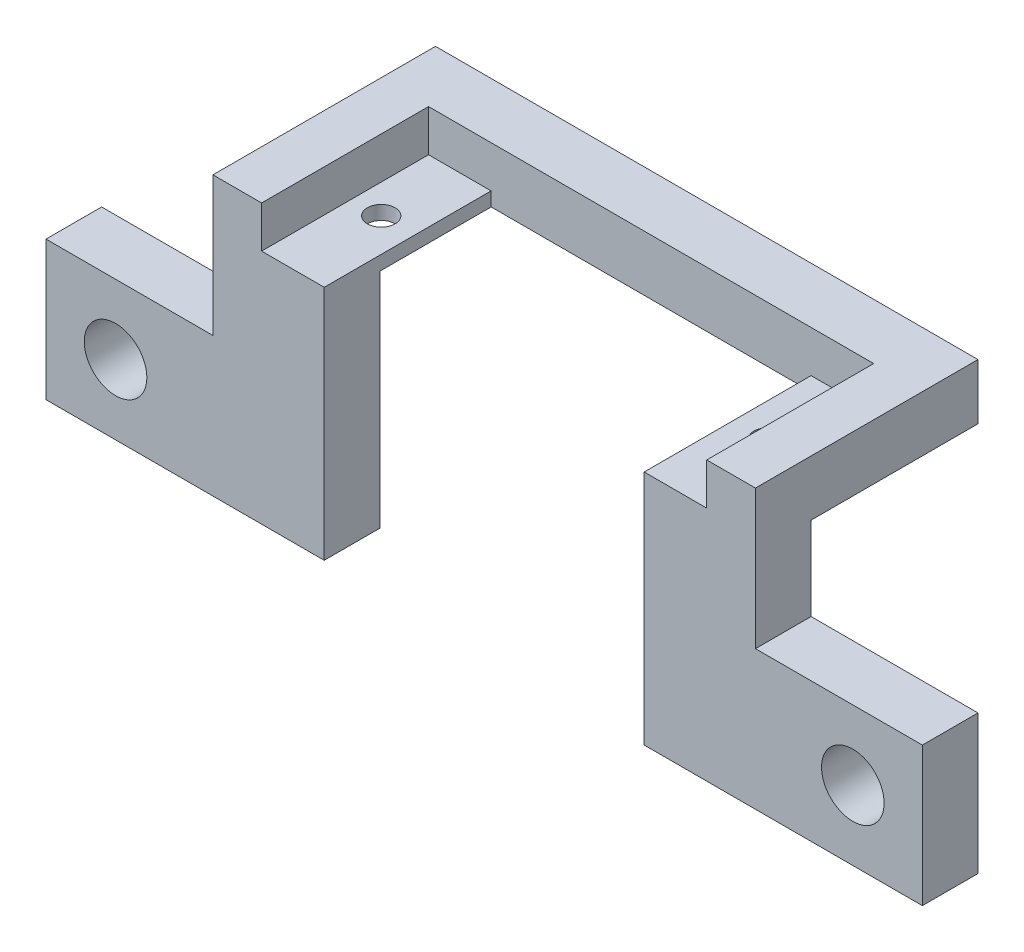
ISO-10303-21;
HEADER;
FILE_DESCRIPTION(('STEP AP214'),'2;1');
FILE_NAME('part.step','',(''),(''),'','','');
FILE_SCHEMA(('AUTOMOTIVE_DESIGN { 1 0 10303 214 1 1 1 1 }'));
ENDSEC;
DATA;
#1=APPLICATION_CONTEXT('core data for automotive mechanical design processes');
#2=APPLICATION_PROTOCOL_DEFINITION('international standard','automotive_design',2000,#1);
#3=PRODUCT_CONTEXT('',#1,'mechanical');
#4=PRODUCT('Part','Part','',(#3));
#5=PRODUCT_RELATED_PRODUCT_CATEGORY('part','',(#4));
#6=PRODUCT_DEFINITION_FORMATION('','',#4);
#7=PRODUCT_DEFINITION_CONTEXT('part definition',#1,'design');
#8=PRODUCT_DEFINITION('design','',#6,#7);
#9=PRODUCT_DEFINITION_SHAPE('','',#8);
#10=(LENGTH_UNIT() NAMED_UNIT(*) SI_UNIT(.MILLI.,.METRE.));
#11=(NAMED_UNIT(*) PLANE_ANGLE_UNIT() SI_UNIT($,.RADIAN.));
#12=(NAMED_UNIT(*) SI_UNIT($,.STERADIAN.) SOLID_ANGLE_UNIT());
#13=UNCERTAINTY_MEASURE_WITH_UNIT(LENGTH_MEASURE(1.E-05),#10,'distance_accuracy_value','');
#14=(GEOMETRIC_REPRESENTATION_CONTEXT(3) GLOBAL_UNCERTAINTY_ASSIGNED_CONTEXT((#13)) GLOBAL_UNIT_ASSIGNED_CONTEXT((#10,
#11,#12)) REPRESENTATION_CONTEXT('',''));
#15=CARTESIAN_POINT('',(0.,0.,0.));
#16=DIRECTION('',(0.,0.,1.));
#17=DIRECTION('',(1.,0.,0.));
#18=AXIS2_PLACEMENT_3D('',#15,#16,#17);
#19=CARTESIAN_POINT('',(-11.5,4.,12.));
#20=DIRECTION('',(-1.,0.,0.));
#21=DIRECTION('',(0.,0.,1.));
#22=AXIS2_PLACEMENT_3D('',#19,#20,#21);
#23=PLANE('',#22);
#24=DIRECTION('',(0.,0.,-1.));
#25=VECTOR('',#24,1.);
#26=CARTESIAN_POINT('',(-11.5,1.,12.));
#27=LINE('',#26,#25);
#28=CARTESIAN_POINT('',(-11.5,1.,12.));
#29=VERTEX_POINT('',#28);
#30=CARTESIAN_POINT('',(-11.5,1.,0.));
#31=VERTEX_POINT('',#30);
#32=EDGE_CURVE('E252',#29,#31,#27,.T.);
#33=ORIENTED_EDGE('',*,*,#32,.F.);
#34=DIRECTION('',(0.,-1.,0.));
#35=VECTOR('',#34,1.);
#36=CARTESIAN_POINT('',(-11.5,4.,12.));
#37=LINE('',#36,#35);
#38=CARTESIAN_POINT('',(-11.5,-16.,12.));
#39=VERTEX_POINT('',#38);
#40=EDGE_CURVE('E220',#29,#39,#37,.T.);
#41=ORIENTED_EDGE('',*,*,#40,.T.);
#42=DIRECTION('',(0.,0.,1.));
#43=VECTOR('',#42,1.);
#44=CARTESIAN_POINT('',(-11.5,-16.,8.));
#45=LINE('',#44,#43);
#46=CARTESIAN_POINT('',(-11.5,-16.,8.));
#47=VERTEX_POINT('',#46);
#48=EDGE_CURVE('E344',#47,#39,#45,.T.);
#49=ORIENTED_EDGE('',*,*,#48,.F.);
#50=DIRECTION('',(0.,1.,0.));
#51=VECTOR('',#50,1.);
#52=CARTESIAN_POINT('',(-11.5,4.,8.));
#53=LINE('',#52,#51);
#54=CARTESIAN_POINT('',(-11.5,0.,8.));
#55=VERTEX_POINT('',#54);
#56=EDGE_CURVE('E330',#47,#55,#53,.T.);
#57=ORIENTED_EDGE('',*,*,#56,.T.);
#58=DIRECTION('',(0.,0.,-1.));
#59=VECTOR('',#58,1.);
#60=CARTESIAN_POINT('',(-11.5,0.,12.));
#61=LINE('',#60,#59);
#62=CARTESIAN_POINT('',(-11.5,0.,0.));
#63=VERTEX_POINT('',#62);
#64=EDGE_CURVE('E390',#55,#63,#61,.T.);
#65=ORIENTED_EDGE('',*,*,#64,.T.);
#66=DIRECTION('',(0.,-1.,0.));
#67=VECTOR('',#66,1.);
#68=CARTESIAN_POINT('',(-11.5,4.,0.));
#69=LINE('',#68,#67);
#70=EDGE_CURVE('E415',#31,#63,#69,.T.);
#71=ORIENTED_EDGE('',*,*,#70,.F.);
#72=EDGE_LOOP('',(#33,#41,#49,#57,#65,#71));
#73=FACE_BOUND('',#72,.T.);
#74=ADVANCED_FACE('F40',(#73),#23,.F.);
#75=CARTESIAN_POINT('',(11.5,4.,12.));
#76=DIRECTION('',(1.,0.,0.));
#77=DIRECTION('',(0.,0.,-1.));
#78=AXIS2_PLACEMENT_3D('',#75,#76,#77);
#79=PLANE('',#78);
#80=DIRECTION('',(0.,0.,1.));
#81=VECTOR('',#80,1.);
#82=CARTESIAN_POINT('',(11.5,1.,12.));
#83=LINE('',#82,#81);
#84=CARTESIAN_POINT('',(11.5,1.,0.));
#85=VERTEX_POINT('',#84);
#86=CARTESIAN_POINT('',(11.5,1.,12.));
#87=VERTEX_POINT('',#86);
#88=EDGE_CURVE('E249',#85,#87,#83,.T.);
#89=ORIENTED_EDGE('',*,*,#88,.F.);
#90=DIRECTION('',(0.,-1.,0.));
#91=VECTOR('',#90,1.);
#92=CARTESIAN_POINT('',(11.5,4.,0.));
#93=LINE('',#92,#91);
#94=CARTESIAN_POINT('',(11.5,0.,0.));
#95=VERTEX_POINT('',#94);
#96=EDGE_CURVE('E412',#85,#95,#93,.T.);
#97=ORIENTED_EDGE('',*,*,#96,.T.);
#98=DIRECTION('',(0.,0.,1.));
#99=VECTOR('',#98,1.);
#100=CARTESIAN_POINT('',(11.5,0.,12.));
#101=LINE('',#100,#99);
#102=CARTESIAN_POINT('',(11.5,0.,8.));
#103=VERTEX_POINT('',#102);
#104=EDGE_CURVE('E398',#95,#103,#101,.T.);
#105=ORIENTED_EDGE('',*,*,#104,.T.);
#106=DIRECTION('',(0.,-1.,0.));
#107=VECTOR('',#106,1.);
#108=CARTESIAN_POINT('',(11.5,4.,8.));
#109=LINE('',#108,#107);
#110=CARTESIAN_POINT('',(11.5,-16.,8.));
#111=VERTEX_POINT('',#110);
#112=EDGE_CURVE('E268',#103,#111,#109,.T.);
#113=ORIENTED_EDGE('',*,*,#112,.T.);
#114=DIRECTION('',(0.,0.,1.));
#115=VECTOR('',#114,1.);
#116=CARTESIAN_POINT('',(11.5,-16.,8.));
#117=LINE('',#116,#115);
#118=CARTESIAN_POINT('',(11.5,-16.,12.));
#119=VERTEX_POINT('',#118);
#120=EDGE_CURVE('E276',#111,#119,#117,.T.);
#121=ORIENTED_EDGE('',*,*,#120,.T.);
#122=DIRECTION('',(0.,-1.,0.));
#123=VECTOR('',#122,1.);
#124=CARTESIAN_POINT('',(11.5,4.,12.));
#125=LINE('',#124,#123);
#126=EDGE_CURVE('E409',#87,#119,#125,.T.);
#127=ORIENTED_EDGE('',*,*,#126,.F.);
#128=EDGE_LOOP('',(#89,#97,#105,#113,#121,#127));
#129=FACE_BOUND('',#128,.T.);
#130=ADVANCED_FACE('F452',(#129),#79,.F.);
#131=CARTESIAN_POINT('',(13.9,4.,5.5));
#132=DIRECTION('',(0.,1.,0.));
#133=DIRECTION('',(0.,0.,1.));
#134=AXIS2_PLACEMENT_3D('',#131,#132,#133);
#135=CYLINDRICAL_SURFACE('',#134,0.999999999999991);
#136=CARTESIAN_POINT('',(13.9,0.,5.5));
#137=DIRECTION('',(0.,1.,0.));
#138=DIRECTION('',(0.,0.,1.));
#139=AXIS2_PLACEMENT_3D('',#136,#137,#138);
#140=CIRCLE('',#139,0.999999999999996);
#141=CARTESIAN_POINT('',(13.9,0.,6.5));
#142=VERTEX_POINT('',#141);
#143=EDGE_CURVE('E361',#142,#142,#140,.T.);
#144=ORIENTED_EDGE('',*,*,#143,.F.);
#145=EDGE_LOOP('',(#144));
#146=FACE_BOUND('',#145,.T.);
#147=CARTESIAN_POINT('',(13.9,1.,5.5));
#148=DIRECTION('',(0.,1.,0.));
#149=DIRECTION('',(0.,0.,1.));
#150=AXIS2_PLACEMENT_3D('',#147,#148,#149);
#151=CIRCLE('',#150,0.999999999999991);
#152=CARTESIAN_POINT('',(13.9,1.,6.49999999999999));
#153=VERTEX_POINT('',#152);
#154=EDGE_CURVE('E245',#153,#153,#151,.F.);
#155=ORIENTED_EDGE('',*,*,#154,.F.);
#156=EDGE_LOOP('',(#155));
#157=FACE_BOUND('',#156,.T.);
#158=ADVANCED_FACE('F458',(#146,#157),#135,.F.);
#159=CARTESIAN_POINT('',(-13.9,4.,5.5));
#160=DIRECTION('',(0.,1.,0.));
#161=DIRECTION('',(0.,0.,1.));
#162=AXIS2_PLACEMENT_3D('',#159,#160,#161);
#163=CYLINDRICAL_SURFACE('',#162,0.999999999999991);
#164=CARTESIAN_POINT('',(-13.9,0.,5.5));
#165=DIRECTION('',(0.,1.,0.));
#166=DIRECTION('',(0.,0.,1.));
#167=AXIS2_PLACEMENT_3D('',#164,#165,#166);
#168=CIRCLE('',#167,0.999999999999996);
#169=CARTESIAN_POINT('',(-13.9,0.,6.5));
#170=VERTEX_POINT('',#169);
#171=EDGE_CURVE('E348',#170,#170,#168,.T.);
#172=ORIENTED_EDGE('',*,*,#171,.F.);
#173=EDGE_LOOP('',(#172));
#174=FACE_BOUND('',#173,.T.);
#175=CARTESIAN_POINT('',(-13.9,1.,5.5));
#176=DIRECTION('',(0.,1.,0.));
#177=DIRECTION('',(0.,0.,1.));
#178=AXIS2_PLACEMENT_3D('',#175,#176,#177);
#179=CIRCLE('',#178,0.999999999999991);
#180=CARTESIAN_POINT('',(-13.9,1.,6.49999999999999));
#181=VERTEX_POINT('',#180);
#182=EDGE_CURVE('E44',#181,#181,#179,.F.);
#183=ORIENTED_EDGE('',*,*,#182,.F.);
#184=EDGE_LOOP('',(#183));
#185=FACE_BOUND('',#184,.T.);
#186=ADVANCED_FACE('F506',(#174,#185),#163,.F.);
#187=CARTESIAN_POINT('',(0.,0.,0.));
#188=DIRECTION('',(0.,-1.,0.));
#189=DIRECTION('',(0.,0.,-1.));
#190=AXIS2_PLACEMENT_3D('',#187,#188,#189);
#191=PLANE('',#190);
#192=ORIENTED_EDGE('',*,*,#171,.T.);
#193=EDGE_LOOP('',(#192));
#194=FACE_BOUND('',#193,.T.);
#195=ORIENTED_EDGE('',*,*,#143,.T.);
#196=EDGE_LOOP('',(#195));
#197=FACE_BOUND('',#196,.T.);
#198=DIRECTION('',(0.,0.,-1.));
#199=VECTOR('',#198,1.);
#200=CARTESIAN_POINT('',(19.5,0.,-4.));
#201=LINE('',#200,#199);
#202=CARTESIAN_POINT('',(19.5,0.,8.));
#203=VERTEX_POINT('',#202);
#204=CARTESIAN_POINT('',(19.5,0.,-4.));
#205=VERTEX_POINT('',#204);
#206=EDGE_CURVE('E88',#203,#205,#201,.T.);
#207=ORIENTED_EDGE('',*,*,#206,.F.);
#208=DIRECTION('',(-1.,0.,0.));
#209=VECTOR('',#208,1.);
#210=CARTESIAN_POINT('',(0.,0.,8.));
#211=LINE('',#210,#209);
#212=EDGE_CURVE('E293',#203,#103,#211,.T.);
#213=ORIENTED_EDGE('',*,*,#212,.T.);
#214=ORIENTED_EDGE('',*,*,#104,.F.);
#215=DIRECTION('',(1.,0.,0.));
#216=VECTOR('',#215,1.);
#217=CARTESIAN_POINT('',(-11.5,0.,0.));
#218=LINE('',#217,#216);
#219=EDGE_CURVE('E394',#63,#95,#218,.T.);
#220=ORIENTED_EDGE('',*,*,#219,.F.);
#221=ORIENTED_EDGE('',*,*,#64,.F.);
#222=DIRECTION('',(-1.,0.,0.));
#223=VECTOR('',#222,1.);
#224=CARTESIAN_POINT('',(0.,0.,8.));
#225=LINE('',#224,#223);
#226=CARTESIAN_POINT('',(-19.5,0.,8.));
#227=VERTEX_POINT('',#226);
#228=EDGE_CURVE('E11',#55,#227,#225,.T.);
#229=ORIENTED_EDGE('',*,*,#228,.T.);
#230=DIRECTION('',(0.,0.,1.));
#231=VECTOR('',#230,1.);
#232=CARTESIAN_POINT('',(-19.5,0.,-4.));
#233=LINE('',#232,#231);
#234=CARTESIAN_POINT('',(-19.5,0.,-4.));
#235=VERTEX_POINT('',#234);
#236=EDGE_CURVE('E386',#235,#227,#233,.T.);
#237=ORIENTED_EDGE('',*,*,#236,.F.);
#238=DIRECTION('',(-1.,0.,0.));
#239=VECTOR('',#238,1.);
#240=CARTESIAN_POINT('',(-19.5,0.,-4.));
#241=LINE('',#240,#239);
#242=EDGE_CURVE('E365',#205,#235,#241,.T.);
#243=ORIENTED_EDGE('',*,*,#242,.F.);
#244=EDGE_LOOP('',(#207,#213,#214,#220,#221,#229,#237,#243));
#245=FACE_BOUND('',#244,.T.);
#246=ADVANCED_FACE('F471',(#194,#197,#245),#191,.T.);
#247=CARTESIAN_POINT('',(-19.5,4.,-4.));
#248=DIRECTION('',(0.,0.,1.));
#249=DIRECTION('',(1.,0.,0.));
#250=AXIS2_PLACEMENT_3D('',#247,#248,#249);
#251=PLANE('',#250);
#252=ORIENTED_EDGE('',*,*,#242,.T.);
#253=DIRECTION('',(0.,-1.,0.));
#254=VECTOR('',#253,1.);
#255=CARTESIAN_POINT('',(-19.5,4.,-4.));
#256=LINE('',#255,#254);
#257=CARTESIAN_POINT('',(-19.5,4.,-4.));
#258=VERTEX_POINT('',#257);
#259=EDGE_CURVE('E50',#258,#235,#256,.T.);
#260=ORIENTED_EDGE('',*,*,#259,.F.);
#261=DIRECTION('',(-1.,0.,0.));
#262=VECTOR('',#261,1.);
#263=CARTESIAN_POINT('',(-19.5,4.,-4.));
#264=LINE('',#263,#262);
#265=CARTESIAN_POINT('',(19.5,4.,-4.));
#266=VERTEX_POINT('',#265);
#267=EDGE_CURVE('E366',#266,#258,#264,.T.);
#268=ORIENTED_EDGE('',*,*,#267,.F.);
#269=DIRECTION('',(0.,-1.,0.));
#270=VECTOR('',#269,1.);
#271=CARTESIAN_POINT('',(19.5,4.,-4.));
#272=LINE('',#271,#270);
#273=EDGE_CURVE('E382',#266,#205,#272,.T.);
#274=ORIENTED_EDGE('',*,*,#273,.T.);
#275=EDGE_LOOP('',(#252,#260,#268,#274));
#276=FACE_BOUND('',#275,.T.);
#277=ADVANCED_FACE('F42',(#276),#251,.F.);
#278=CARTESIAN_POINT('',(-19.5,4.,-4.));
#279=DIRECTION('',(1.,0.,0.));
#280=DIRECTION('',(0.,0.,-1.));
#281=AXIS2_PLACEMENT_3D('',#278,#279,#280);
#282=PLANE('',#281);
#283=DIRECTION('',(0.,-1.,0.));
#284=VECTOR('',#283,1.);
#285=CARTESIAN_POINT('',(-19.5,4.,12.));
#286=LINE('',#285,#284);
#287=CARTESIAN_POINT('',(-19.5,4.,12.));
#288=VERTEX_POINT('',#287);
#289=CARTESIAN_POINT('',(-19.5,-6.,12.));
#290=VERTEX_POINT('',#289);
#291=EDGE_CURVE('E420',#288,#290,#286,.T.);
#292=ORIENTED_EDGE('',*,*,#291,.F.);
#293=DIRECTION('',(0.,0.,1.));
#294=VECTOR('',#293,1.);
#295=CARTESIAN_POINT('',(-19.5,4.,-4.));
#296=LINE('',#295,#294);
#297=EDGE_CURVE('E96',#258,#288,#296,.T.);
#298=ORIENTED_EDGE('',*,*,#297,.F.);
#299=ORIENTED_EDGE('',*,*,#259,.T.);
#300=ORIENTED_EDGE('',*,*,#236,.T.);
#301=DIRECTION('',(0.,-1.,0.));
#302=VECTOR('',#301,1.);
#303=CARTESIAN_POINT('',(-19.5,4.,8.));
#304=LINE('',#303,#302);
#305=CARTESIAN_POINT('',(-19.5,-6.,8.));
#306=VERTEX_POINT('',#305);
#307=EDGE_CURVE('E314',#227,#306,#304,.T.);
#308=ORIENTED_EDGE('',*,*,#307,.T.);
#309=DIRECTION('',(0.,0.,1.));
#310=VECTOR('',#309,1.);
#311=CARTESIAN_POINT('',(-19.5,-6.,8.));
#312=LINE('',#311,#310);
#313=EDGE_CURVE('E334',#306,#290,#312,.T.);
#314=ORIENTED_EDGE('',*,*,#313,.T.);
#315=EDGE_LOOP('',(#292,#298,#299,#300,#308,#314));
#316=FACE_BOUND('',#315,.T.);
#317=ADVANCED_FACE('F465',(#316),#282,.F.);
#318=CARTESIAN_POINT('',(-19.5,4.,12.));
#319=DIRECTION('',(0.,0.,-1.));
#320=DIRECTION('',(-1.,0.,0.));
#321=AXIS2_PLACEMENT_3D('',#318,#319,#320);
#322=PLANE('',#321);
#323=CARTESIAN_POINT('',(-26.5,-11.,12.));
#324=DIRECTION('',(0.,0.,1.));
#325=DIRECTION('',(1.,0.,0.));
#326=AXIS2_PLACEMENT_3D('',#323,#324,#325);
#327=CIRCLE('',#326,2.24999999999999);
#328=CARTESIAN_POINT('',(-24.25,-11.,12.));
#329=VERTEX_POINT('',#328);
#330=EDGE_CURVE('E255',#329,#329,#327,.T.);
#331=ORIENTED_EDGE('',*,*,#330,.F.);
#332=EDGE_LOOP('',(#331));
#333=FACE_BOUND('',#332,.T.);
#334=DIRECTION('',(1.,0.,0.));
#335=VECTOR('',#334,1.);
#336=CARTESIAN_POINT('',(-16.,1.,12.));
#337=LINE('',#336,#335);
#338=CARTESIAN_POINT('',(-16.,1.,12.));
#339=VERTEX_POINT('',#338);
#340=EDGE_CURVE('E208',#339,#29,#337,.T.);
#341=ORIENTED_EDGE('',*,*,#340,.F.);
#342=DIRECTION('',(0.,1.,0.));
#343=VECTOR('',#342,1.);
#344=CARTESIAN_POINT('',(-16.,1.,12.));
#345=LINE('',#344,#343);
#346=CARTESIAN_POINT('',(-16.,4.,12.));
#347=VERTEX_POINT('',#346);
#348=EDGE_CURVE('E192',#339,#347,#345,.T.);
#349=ORIENTED_EDGE('',*,*,#348,.T.);
#350=DIRECTION('',(1.,0.,0.));
#351=VECTOR('',#350,1.);
#352=CARTESIAN_POINT('',(-19.5,4.,12.));
#353=LINE('',#352,#351);
#354=EDGE_CURVE('E371',#288,#347,#353,.T.);
#355=ORIENTED_EDGE('',*,*,#354,.F.);
#356=ORIENTED_EDGE('',*,*,#291,.T.);
#357=DIRECTION('',(-1.,0.,0.));
#358=VECTOR('',#357,1.);
#359=CARTESIAN_POINT('',(-31.5,-6.,12.));
#360=LINE('',#359,#358);
#361=CARTESIAN_POINT('',(-31.5,-6.,12.));
#362=VERTEX_POINT('',#361);
#363=EDGE_CURVE('E313',#290,#362,#360,.T.);
#364=ORIENTED_EDGE('',*,*,#363,.T.);
#365=DIRECTION('',(0.,-1.,0.));
#366=VECTOR('',#365,1.);
#367=CARTESIAN_POINT('',(-31.5,-16.,12.));
#368=LINE('',#367,#366);
#369=CARTESIAN_POINT('',(-31.5,-16.,12.));
#370=VERTEX_POINT('',#369);
#371=EDGE_CURVE('E338',#362,#370,#368,.T.);
#372=ORIENTED_EDGE('',*,*,#371,.T.);
#373=DIRECTION('',(1.,0.,0.));
#374=VECTOR('',#373,1.);
#375=CARTESIAN_POINT('',(-31.5,-16.,12.));
#376=LINE('',#375,#374);
#377=EDGE_CURVE('E318',#370,#39,#376,.T.);
#378=ORIENTED_EDGE('',*,*,#377,.T.);
#379=ORIENTED_EDGE('',*,*,#40,.F.);
#380=EDGE_LOOP('',(#341,#349,#355,#356,#364,#372,#378,#379));
#381=FACE_BOUND('',#380,.T.);
#382=ADVANCED_FACE('F218',(#333,#381),#322,.F.);
#383=CARTESIAN_POINT('',(-11.5,4.,0.));
#384=DIRECTION('',(0.,0.,-1.));
#385=DIRECTION('',(-1.,0.,0.));
#386=AXIS2_PLACEMENT_3D('',#383,#384,#385);
#387=PLANE('',#386);
#388=DIRECTION('',(1.,0.,0.));
#389=VECTOR('',#388,1.);
#390=CARTESIAN_POINT('',(-11.5,4.,0.));
#391=LINE('',#390,#389);
#392=CARTESIAN_POINT('',(-16.,4.,0.));
#393=VERTEX_POINT('',#392);
#394=CARTESIAN_POINT('',(16.,4.,0.));
#395=VERTEX_POINT('',#394);
#396=EDGE_CURVE('E374',#393,#395,#391,.T.);
#397=ORIENTED_EDGE('',*,*,#396,.F.);
#398=DIRECTION('',(0.,1.,0.));
#399=VECTOR('',#398,1.);
#400=CARTESIAN_POINT('',(-16.,1.,0.));
#401=LINE('',#400,#399);
#402=CARTESIAN_POINT('',(-16.,1.,0.));
#403=VERTEX_POINT('',#402);
#404=EDGE_CURVE('E236',#403,#393,#401,.T.);
#405=ORIENTED_EDGE('',*,*,#404,.F.);
#406=DIRECTION('',(-1.,0.,0.));
#407=VECTOR('',#406,1.);
#408=CARTESIAN_POINT('',(-16.,1.,0.));
#409=LINE('',#408,#407);
#410=EDGE_CURVE('E211',#31,#403,#409,.T.);
#411=ORIENTED_EDGE('',*,*,#410,.F.);
#412=ORIENTED_EDGE('',*,*,#70,.T.);
#413=ORIENTED_EDGE('',*,*,#219,.T.);
#414=ORIENTED_EDGE('',*,*,#96,.F.);
#415=CARTESIAN_POINT('',(16.,1.,0.));
#416=VERTEX_POINT('',#415);
#417=EDGE_CURVE('E204',#416,#85,#409,.T.);
#418=ORIENTED_EDGE('',*,*,#417,.F.);
#419=DIRECTION('',(0.,1.,0.));
#420=VECTOR('',#419,1.);
#421=CARTESIAN_POINT('',(16.,1.,0.));
#422=LINE('',#421,#420);
#423=EDGE_CURVE('E239',#416,#395,#422,.T.);
#424=ORIENTED_EDGE('',*,*,#423,.T.);
#425=EDGE_LOOP('',(#397,#405,#411,#412,#413,#414,#418,#424));
#426=FACE_BOUND('',#425,.T.);
#427=ADVANCED_FACE('F463',(#426),#387,.F.);
#428=CARTESIAN_POINT('',(19.5,4.,12.));
#429=DIRECTION('',(0.,0.,-1.));
#430=DIRECTION('',(-1.,0.,0.));
#431=AXIS2_PLACEMENT_3D('',#428,#429,#430);
#432=PLANE('',#431);
#433=CARTESIAN_POINT('',(26.5,-11.,12.));
#434=DIRECTION('',(0.,0.,1.));
#435=DIRECTION('',(1.,0.,0.));
#436=AXIS2_PLACEMENT_3D('',#433,#434,#435);
#437=CIRCLE('',#436,2.24999999999999);
#438=CARTESIAN_POINT('',(28.75,-11.,12.));
#439=VERTEX_POINT('',#438);
#440=EDGE_CURVE('E260',#439,#439,#437,.T.);
#441=ORIENTED_EDGE('',*,*,#440,.F.);
#442=EDGE_LOOP('',(#441));
#443=FACE_BOUND('',#442,.T.);
#444=DIRECTION('',(1.,0.,0.));
#445=VECTOR('',#444,1.);
#446=CARTESIAN_POINT('',(19.5,4.,12.));
#447=LINE('',#446,#445);
#448=CARTESIAN_POINT('',(16.,4.,12.));
#449=VERTEX_POINT('',#448);
#450=CARTESIAN_POINT('',(19.5,4.,12.));
#451=VERTEX_POINT('',#450);
#452=EDGE_CURVE('E377',#449,#451,#447,.T.);
#453=ORIENTED_EDGE('',*,*,#452,.F.);
#454=DIRECTION('',(0.,1.,0.));
#455=VECTOR('',#454,1.);
#456=CARTESIAN_POINT('',(16.,1.,12.));
#457=LINE('',#456,#455);
#458=CARTESIAN_POINT('',(16.,1.,12.));
#459=VERTEX_POINT('',#458);
#460=EDGE_CURVE('E58',#459,#449,#457,.T.);
#461=ORIENTED_EDGE('',*,*,#460,.F.);
#462=EDGE_CURVE('E214',#87,#459,#337,.T.);
#463=ORIENTED_EDGE('',*,*,#462,.F.);
#464=ORIENTED_EDGE('',*,*,#126,.T.);
#465=DIRECTION('',(1.,0.,0.));
#466=VECTOR('',#465,1.);
#467=CARTESIAN_POINT('',(31.5,-16.,12.));
#468=LINE('',#467,#466);
#469=CARTESIAN_POINT('',(31.5,-16.,12.));
#470=VERTEX_POINT('',#469);
#471=EDGE_CURVE('E289',#119,#470,#468,.T.);
#472=ORIENTED_EDGE('',*,*,#471,.T.);
#473=DIRECTION('',(0.,1.,0.));
#474=VECTOR('',#473,1.);
#475=CARTESIAN_POINT('',(31.5,-16.,12.));
#476=LINE('',#475,#474);
#477=CARTESIAN_POINT('',(31.5,-6.,12.));
#478=VERTEX_POINT('',#477);
#479=EDGE_CURVE('E284',#470,#478,#476,.T.);
#480=ORIENTED_EDGE('',*,*,#479,.T.);
#481=DIRECTION('',(-1.,0.,0.));
#482=VECTOR('',#481,1.);
#483=CARTESIAN_POINT('',(31.5,-6.,12.));
#484=LINE('',#483,#482);
#485=CARTESIAN_POINT('',(19.5,-6.,12.));
#486=VERTEX_POINT('',#485);
#487=EDGE_CURVE('E280',#478,#486,#484,.T.);
#488=ORIENTED_EDGE('',*,*,#487,.T.);
#489=DIRECTION('',(0.,-1.,0.));
#490=VECTOR('',#489,1.);
#491=CARTESIAN_POINT('',(19.5,4.,12.));
#492=LINE('',#491,#490);
#493=EDGE_CURVE('E406',#451,#486,#492,.T.);
#494=ORIENTED_EDGE('',*,*,#493,.F.);
#495=EDGE_LOOP('',(#453,#461,#463,#464,#472,#480,#488,#494));
#496=FACE_BOUND('',#495,.T.);
#497=ADVANCED_FACE('F521',(#443,#496),#432,.F.);
#498=CARTESIAN_POINT('',(19.5,4.,-4.));
#499=DIRECTION('',(-1.,0.,0.));
#500=DIRECTION('',(0.,0.,1.));
#501=AXIS2_PLACEMENT_3D('',#498,#499,#500);
#502=PLANE('',#501);
#503=ORIENTED_EDGE('',*,*,#493,.T.);
#504=DIRECTION('',(0.,0.,1.));
#505=VECTOR('',#504,1.);
#506=CARTESIAN_POINT('',(19.5,-6.,8.));
#507=LINE('',#506,#505);
#508=CARTESIAN_POINT('',(19.5,-6.,8.));
#509=VERTEX_POINT('',#508);
#510=EDGE_CURVE('E272',#509,#486,#507,.T.);
#511=ORIENTED_EDGE('',*,*,#510,.F.);
#512=DIRECTION('',(0.,1.,0.));
#513=VECTOR('',#512,1.);
#514=CARTESIAN_POINT('',(19.5,4.,8.));
#515=LINE('',#514,#513);
#516=EDGE_CURVE('E296',#509,#203,#515,.T.);
#517=ORIENTED_EDGE('',*,*,#516,.T.);
#518=ORIENTED_EDGE('',*,*,#206,.T.);
#519=ORIENTED_EDGE('',*,*,#273,.F.);
#520=DIRECTION('',(0.,0.,-1.));
#521=VECTOR('',#520,1.);
#522=CARTESIAN_POINT('',(19.5,4.,-4.));
#523=LINE('',#522,#521);
#524=EDGE_CURVE('E67',#451,#266,#523,.T.);
#525=ORIENTED_EDGE('',*,*,#524,.F.);
#526=EDGE_LOOP('',(#503,#511,#517,#518,#519,#525));
#527=FACE_BOUND('',#526,.T.);
#528=ADVANCED_FACE('F515',(#527),#502,.F.);
#529=CARTESIAN_POINT('',(0.,4.,0.));
#530=DIRECTION('',(0.,-1.,0.));
#531=DIRECTION('',(0.,0.,-1.));
#532=AXIS2_PLACEMENT_3D('',#529,#530,#531);
#533=PLANE('',#532);
#534=ORIENTED_EDGE('',*,*,#354,.T.);
#535=DIRECTION('',(0.,0.,1.));
#536=VECTOR('',#535,1.);
#537=CARTESIAN_POINT('',(-16.,4.,0.));
#538=LINE('',#537,#536);
#539=EDGE_CURVE('E198',#393,#347,#538,.T.);
#540=ORIENTED_EDGE('',*,*,#539,.F.);
#541=ORIENTED_EDGE('',*,*,#396,.T.);
#542=DIRECTION('',(0.,0.,-1.));
#543=VECTOR('',#542,1.);
#544=CARTESIAN_POINT('',(16.,4.,0.));
#545=LINE('',#544,#543);
#546=EDGE_CURVE('E215',#449,#395,#545,.T.);
#547=ORIENTED_EDGE('',*,*,#546,.F.);
#548=ORIENTED_EDGE('',*,*,#452,.T.);
#549=ORIENTED_EDGE('',*,*,#524,.T.);
#550=ORIENTED_EDGE('',*,*,#267,.T.);
#551=ORIENTED_EDGE('',*,*,#297,.T.);
#552=EDGE_LOOP('',(#534,#540,#541,#547,#548,#549,#550,#551));
#553=FACE_BOUND('',#552,.T.);
#554=ADVANCED_FACE('F475',(#553),#533,.F.);
#555=CARTESIAN_POINT('',(-31.5,-16.,8.));
#556=DIRECTION('',(0.,-1.,0.));
#557=DIRECTION('',(0.,0.,-1.));
#558=AXIS2_PLACEMENT_3D('',#555,#556,#557);
#559=PLANE('',#558);
#560=ORIENTED_EDGE('',*,*,#377,.F.);
#561=DIRECTION('',(0.,0.,1.));
#562=VECTOR('',#561,1.);
#563=CARTESIAN_POINT('',(-31.5,-16.,8.));
#564=LINE('',#563,#562);
#565=CARTESIAN_POINT('',(-31.5,-16.,8.));
#566=VERTEX_POINT('',#565);
#567=EDGE_CURVE('E349',#566,#370,#564,.T.);
#568=ORIENTED_EDGE('',*,*,#567,.F.);
#569=DIRECTION('',(1.,0.,0.));
#570=VECTOR('',#569,1.);
#571=CARTESIAN_POINT('',(-31.5,-16.,8.));
#572=LINE('',#571,#570);
#573=EDGE_CURVE('E326',#566,#47,#572,.T.);
#574=ORIENTED_EDGE('',*,*,#573,.T.);
#575=ORIENTED_EDGE('',*,*,#48,.T.);
#576=EDGE_LOOP('',(#560,#568,#574,#575));
#577=FACE_BOUND('',#576,.T.);
#578=ADVANCED_FACE('F488',(#577),#559,.T.);
#579=CARTESIAN_POINT('',(-31.5,-16.,8.));
#580=DIRECTION('',(-1.,0.,0.));
#581=DIRECTION('',(0.,0.,1.));
#582=AXIS2_PLACEMENT_3D('',#579,#580,#581);
#583=PLANE('',#582);
#584=ORIENTED_EDGE('',*,*,#371,.F.);
#585=DIRECTION('',(0.,0.,1.));
#586=VECTOR('',#585,1.);
#587=CARTESIAN_POINT('',(-31.5,-6.,8.));
#588=LINE('',#587,#586);
#589=CARTESIAN_POINT('',(-31.5,-6.,8.));
#590=VERTEX_POINT('',#589);
#591=EDGE_CURVE('E352',#590,#362,#588,.T.);
#592=ORIENTED_EDGE('',*,*,#591,.F.);
#593=DIRECTION('',(0.,-1.,0.));
#594=VECTOR('',#593,1.);
#595=CARTESIAN_POINT('',(-31.5,-16.,8.));
#596=LINE('',#595,#594);
#597=EDGE_CURVE('E322',#590,#566,#596,.T.);
#598=ORIENTED_EDGE('',*,*,#597,.T.);
#599=ORIENTED_EDGE('',*,*,#567,.T.);
#600=EDGE_LOOP('',(#584,#592,#598,#599));
#601=FACE_BOUND('',#600,.T.);
#602=ADVANCED_FACE('F491',(#601),#583,.T.);
#603=CARTESIAN_POINT('',(-31.5,-6.,8.));
#604=DIRECTION('',(0.,1.,0.));
#605=DIRECTION('',(0.,0.,1.));
#606=AXIS2_PLACEMENT_3D('',#603,#604,#605);
#607=PLANE('',#606);
#608=ORIENTED_EDGE('',*,*,#363,.F.);
#609=ORIENTED_EDGE('',*,*,#313,.F.);
#610=DIRECTION('',(-1.,0.,0.));
#611=VECTOR('',#610,1.);
#612=CARTESIAN_POINT('',(-31.5,-6.,8.));
#613=LINE('',#612,#611);
#614=EDGE_CURVE('E317',#306,#590,#613,.T.);
#615=ORIENTED_EDGE('',*,*,#614,.T.);
#616=ORIENTED_EDGE('',*,*,#591,.T.);
#617=EDGE_LOOP('',(#608,#609,#615,#616));
#618=FACE_BOUND('',#617,.T.);
#619=ADVANCED_FACE('F494',(#618),#607,.T.);
#620=CARTESIAN_POINT('',(0.,0.,8.));
#621=DIRECTION('',(0.,0.,1.));
#622=DIRECTION('',(1.,0.,0.));
#623=AXIS2_PLACEMENT_3D('',#620,#621,#622);
#624=PLANE('',#623);
#625=CARTESIAN_POINT('',(-26.5,-11.,8.));
#626=DIRECTION('',(0.,0.,1.));
#627=DIRECTION('',(1.,0.,0.));
#628=AXIS2_PLACEMENT_3D('',#625,#626,#627);
#629=CIRCLE('',#628,2.24999999999999);
#630=CARTESIAN_POINT('',(-24.25,-11.,8.));
#631=VERTEX_POINT('',#630);
#632=EDGE_CURVE('E259',#631,#631,#629,.T.);
#633=ORIENTED_EDGE('',*,*,#632,.T.);
#634=EDGE_LOOP('',(#633));
#635=FACE_BOUND('',#634,.T.);
#636=ORIENTED_EDGE('',*,*,#228,.F.);
#637=ORIENTED_EDGE('',*,*,#56,.F.);
#638=ORIENTED_EDGE('',*,*,#573,.F.);
#639=ORIENTED_EDGE('',*,*,#597,.F.);
#640=ORIENTED_EDGE('',*,*,#614,.F.);
#641=ORIENTED_EDGE('',*,*,#307,.F.);
#642=EDGE_LOOP('',(#636,#637,#638,#639,#640,#641));
#643=FACE_BOUND('',#642,.T.);
#644=ADVANCED_FACE('F432',(#635,#643),#624,.F.);
#645=CARTESIAN_POINT('',(31.5,-16.,8.));
#646=DIRECTION('',(0.,-1.,0.));
#647=DIRECTION('',(0.,0.,-1.));
#648=AXIS2_PLACEMENT_3D('',#645,#646,#647);
#649=PLANE('',#648);
#650=ORIENTED_EDGE('',*,*,#471,.F.);
#651=ORIENTED_EDGE('',*,*,#120,.F.);
#652=DIRECTION('',(1.,0.,0.));
#653=VECTOR('',#652,1.);
#654=CARTESIAN_POINT('',(31.5,-16.,8.));
#655=LINE('',#654,#653);
#656=CARTESIAN_POINT('',(31.5,-16.,8.));
#657=VERTEX_POINT('',#656);
#658=EDGE_CURVE('E285',#111,#657,#655,.T.);
#659=ORIENTED_EDGE('',*,*,#658,.T.);
#660=DIRECTION('',(0.,0.,1.));
#661=VECTOR('',#660,1.);
#662=CARTESIAN_POINT('',(31.5,-16.,8.));
#663=LINE('',#662,#661);
#664=EDGE_CURVE('E265',#657,#470,#663,.T.);
#665=ORIENTED_EDGE('',*,*,#664,.T.);
#666=EDGE_LOOP('',(#650,#651,#659,#665));
#667=FACE_BOUND('',#666,.T.);
#668=ADVANCED_FACE('F501',(#667),#649,.T.);
#669=CARTESIAN_POINT('',(31.5,-6.,8.));
#670=DIRECTION('',(0.,1.,0.));
#671=DIRECTION('',(0.,0.,1.));
#672=AXIS2_PLACEMENT_3D('',#669,#670,#671);
#673=PLANE('',#672);
#674=ORIENTED_EDGE('',*,*,#487,.F.);
#675=DIRECTION('',(0.,0.,1.));
#676=VECTOR('',#675,1.);
#677=CARTESIAN_POINT('',(31.5,-6.,8.));
#678=LINE('',#677,#676);
#679=CARTESIAN_POINT('',(31.5,-6.,8.));
#680=VERTEX_POINT('',#679);
#681=EDGE_CURVE('E269',#680,#478,#678,.T.);
#682=ORIENTED_EDGE('',*,*,#681,.F.);
#683=DIRECTION('',(-1.,0.,0.));
#684=VECTOR('',#683,1.);
#685=CARTESIAN_POINT('',(31.5,-6.,8.));
#686=LINE('',#685,#684);
#687=EDGE_CURVE('E299',#680,#509,#686,.T.);
#688=ORIENTED_EDGE('',*,*,#687,.T.);
#689=ORIENTED_EDGE('',*,*,#510,.T.);
#690=EDGE_LOOP('',(#674,#682,#688,#689));
#691=FACE_BOUND('',#690,.T.);
#692=ADVANCED_FACE('F550',(#691),#673,.T.);
#693=CARTESIAN_POINT('',(31.5,-16.,8.));
#694=DIRECTION('',(1.,0.,0.));
#695=DIRECTION('',(0.,0.,-1.));
#696=AXIS2_PLACEMENT_3D('',#693,#694,#695);
#697=PLANE('',#696);
#698=ORIENTED_EDGE('',*,*,#479,.F.);
#699=ORIENTED_EDGE('',*,*,#664,.F.);
#700=DIRECTION('',(0.,1.,0.));
#701=VECTOR('',#700,1.);
#702=CARTESIAN_POINT('',(31.5,-16.,8.));
#703=LINE('',#702,#701);
#704=EDGE_CURVE('E303',#657,#680,#703,.T.);
#705=ORIENTED_EDGE('',*,*,#704,.T.);
#706=ORIENTED_EDGE('',*,*,#681,.T.);
#707=EDGE_LOOP('',(#698,#699,#705,#706));
#708=FACE_BOUND('',#707,.T.);
#709=ADVANCED_FACE('F547',(#708),#697,.T.);
#710=CARTESIAN_POINT('',(0.,0.,8.));
#711=DIRECTION('',(0.,0.,1.));
#712=DIRECTION('',(1.,0.,0.));
#713=AXIS2_PLACEMENT_3D('',#710,#711,#712);
#714=PLANE('',#713);
#715=CARTESIAN_POINT('',(26.5,-11.,8.));
#716=DIRECTION('',(0.,0.,1.));
#717=DIRECTION('',(1.,0.,0.));
#718=AXIS2_PLACEMENT_3D('',#715,#716,#717);
#719=CIRCLE('',#718,2.24999999999999);
#720=CARTESIAN_POINT('',(28.75,-11.,8.));
#721=VERTEX_POINT('',#720);
#722=EDGE_CURVE('E264',#721,#721,#719,.T.);
#723=ORIENTED_EDGE('',*,*,#722,.T.);
#724=EDGE_LOOP('',(#723));
#725=FACE_BOUND('',#724,.T.);
#726=ORIENTED_EDGE('',*,*,#212,.F.);
#727=ORIENTED_EDGE('',*,*,#516,.F.);
#728=ORIENTED_EDGE('',*,*,#687,.F.);
#729=ORIENTED_EDGE('',*,*,#704,.F.);
#730=ORIENTED_EDGE('',*,*,#658,.F.);
#731=ORIENTED_EDGE('',*,*,#112,.F.);
#732=EDGE_LOOP('',(#726,#727,#728,#729,#730,#731));
#733=FACE_BOUND('',#732,.T.);
#734=ADVANCED_FACE('F447',(#725,#733),#714,.F.);
#735=CARTESIAN_POINT('',(26.5,-11.,12.));
#736=DIRECTION('',(0.,0.,1.));
#737=DIRECTION('',(1.,0.,0.));
#738=AXIS2_PLACEMENT_3D('',#735,#736,#737);
#739=CYLINDRICAL_SURFACE('',#738,2.24999999999999);
#740=ORIENTED_EDGE('',*,*,#440,.T.);
#741=EDGE_LOOP('',(#740));
#742=FACE_BOUND('',#741,.T.);
#743=ORIENTED_EDGE('',*,*,#722,.F.);
#744=EDGE_LOOP('',(#743));
#745=FACE_BOUND('',#744,.T.);
#746=ADVANCED_FACE('F437',(#742,#745),#739,.F.);
#747=CARTESIAN_POINT('',(-26.5,-11.,12.));
#748=DIRECTION('',(0.,0.,1.));
#749=DIRECTION('',(1.,0.,0.));
#750=AXIS2_PLACEMENT_3D('',#747,#748,#749);
#751=CYLINDRICAL_SURFACE('',#750,2.24999999999999);
#752=ORIENTED_EDGE('',*,*,#330,.T.);
#753=EDGE_LOOP('',(#752));
#754=FACE_BOUND('',#753,.T.);
#755=ORIENTED_EDGE('',*,*,#632,.F.);
#756=EDGE_LOOP('',(#755));
#757=FACE_BOUND('',#756,.T.);
#758=ADVANCED_FACE('F435',(#754,#757),#751,.F.);
#759=CARTESIAN_POINT('',(0.,1.,0.));
#760=DIRECTION('',(0.,1.,0.));
#761=DIRECTION('',(0.,0.,1.));
#762=AXIS2_PLACEMENT_3D('',#759,#760,#761);
#763=PLANE('',#762);
#764=ORIENTED_EDGE('',*,*,#182,.T.);
#765=EDGE_LOOP('',(#764));
#766=FACE_BOUND('',#765,.T.);
#767=ORIENTED_EDGE('',*,*,#32,.T.);
#768=ORIENTED_EDGE('',*,*,#410,.T.);
#769=DIRECTION('',(0.,0.,1.));
#770=VECTOR('',#769,1.);
#771=CARTESIAN_POINT('',(-16.,1.,0.));
#772=LINE('',#771,#770);
#773=EDGE_CURVE('E196',#403,#339,#772,.T.);
#774=ORIENTED_EDGE('',*,*,#773,.T.);
#775=ORIENTED_EDGE('',*,*,#340,.T.);
#776=EDGE_LOOP('',(#767,#768,#774,#775));
#777=FACE_BOUND('',#776,.T.);
#778=ADVANCED_FACE('F207',(#766,#777),#763,.T.);
#779=CARTESIAN_POINT('',(-16.,1.,0.));
#780=DIRECTION('',(-1.,0.,0.));
#781=DIRECTION('',(0.,0.,1.));
#782=AXIS2_PLACEMENT_3D('',#779,#780,#781);
#783=PLANE('',#782);
#784=ORIENTED_EDGE('',*,*,#539,.T.);
#785=ORIENTED_EDGE('',*,*,#348,.F.);
#786=ORIENTED_EDGE('',*,*,#773,.F.);
#787=ORIENTED_EDGE('',*,*,#404,.T.);
#788=EDGE_LOOP('',(#784,#785,#786,#787));
#789=FACE_BOUND('',#788,.T.);
#790=ADVANCED_FACE('F194',(#789),#783,.F.);
#791=ORIENTED_EDGE('',*,*,#154,.T.);
#792=EDGE_LOOP('',(#791));
#793=FACE_BOUND('',#792,.T.);
#794=ORIENTED_EDGE('',*,*,#88,.T.);
#795=ORIENTED_EDGE('',*,*,#462,.T.);
#796=DIRECTION('',(0.,0.,-1.));
#797=VECTOR('',#796,1.);
#798=CARTESIAN_POINT('',(16.,1.,0.));
#799=LINE('',#798,#797);
#800=EDGE_CURVE('E222',#459,#416,#799,.T.);
#801=ORIENTED_EDGE('',*,*,#800,.T.);
#802=ORIENTED_EDGE('',*,*,#417,.T.);
#803=EDGE_LOOP('',(#794,#795,#801,#802));
#804=FACE_BOUND('',#803,.T.);
#805=ADVANCED_FACE('F446',(#793,#804),#763,.T.);
#806=CARTESIAN_POINT('',(16.,1.,0.));
#807=DIRECTION('',(1.,0.,0.));
#808=DIRECTION('',(0.,0.,-1.));
#809=AXIS2_PLACEMENT_3D('',#806,#807,#808);
#810=PLANE('',#809);
#811=ORIENTED_EDGE('',*,*,#546,.T.);
#812=ORIENTED_EDGE('',*,*,#423,.F.);
#813=ORIENTED_EDGE('',*,*,#800,.F.);
#814=ORIENTED_EDGE('',*,*,#460,.T.);
#815=EDGE_LOOP('',(#811,#812,#813,#814));
#816=FACE_BOUND('',#815,.T.);
#817=ADVANCED_FACE('F533',(#816),#810,.F.);
#818=CLOSED_SHELL('',(#74,#130,#158,#186,#246,#277,#317,#382,#427,#497,#528,#554,#578,#602,#619,
#644,#668,#692,#709,#734,#746,#758,#778,#790,#805,#817));
#819=MANIFOLD_SOLID_BREP('B2',#818);
#820=ADVANCED_BREP_SHAPE_REPRESENTATION('',(#18,#819),#14);
#821=SHAPE_DEFINITION_REPRESENTATION(#9,#820);
ENDSEC;
END-ISO-10303-21;
